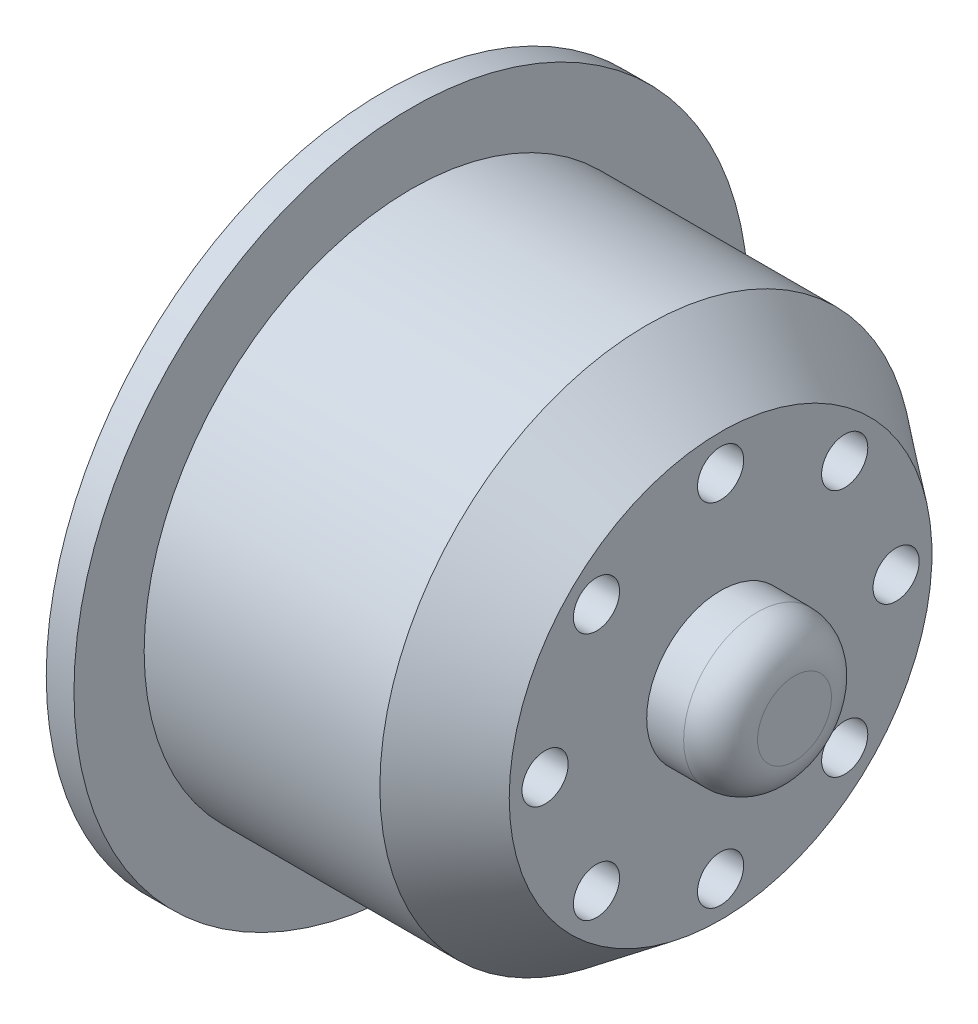
ISO-10303-21;
HEADER;
FILE_DESCRIPTION(('STEP AP214'),'2;1');
FILE_NAME('part.step','',(''),(''),'','','');
FILE_SCHEMA(('AUTOMOTIVE_DESIGN { 1 0 10303 214 1 1 1 1 }'));
ENDSEC;
DATA;
#1=APPLICATION_CONTEXT('core data for automotive mechanical design processes');
#2=APPLICATION_PROTOCOL_DEFINITION('international standard','automotive_design',2000,#1);
#3=PRODUCT_CONTEXT('',#1,'mechanical');
#4=PRODUCT('Part','Part','',(#3));
#5=PRODUCT_RELATED_PRODUCT_CATEGORY('part','',(#4));
#6=PRODUCT_DEFINITION_FORMATION('','',#4);
#7=PRODUCT_DEFINITION_CONTEXT('part definition',#1,'design');
#8=PRODUCT_DEFINITION('design','',#6,#7);
#9=PRODUCT_DEFINITION_SHAPE('','',#8);
#10=(LENGTH_UNIT() NAMED_UNIT(*) SI_UNIT(.MILLI.,.METRE.));
#11=(NAMED_UNIT(*) PLANE_ANGLE_UNIT() SI_UNIT($,.RADIAN.));
#12=(NAMED_UNIT(*) SI_UNIT($,.STERADIAN.) SOLID_ANGLE_UNIT());
#13=UNCERTAINTY_MEASURE_WITH_UNIT(LENGTH_MEASURE(1.E-05),#10,'distance_accuracy_value','');
#14=(GEOMETRIC_REPRESENTATION_CONTEXT(3) GLOBAL_UNCERTAINTY_ASSIGNED_CONTEXT((#13)) GLOBAL_UNIT_ASSIGNED_CONTEXT((#10,
#11,#12)) REPRESENTATION_CONTEXT('',''));
#15=CARTESIAN_POINT('',(0.,0.,0.));
#16=DIRECTION('',(0.,0.,1.));
#17=DIRECTION('',(1.,0.,0.));
#18=AXIS2_PLACEMENT_3D('',#15,#16,#17);
#19=CARTESIAN_POINT('',(-7.6304347826087,6.71751442127166,6.71751442127198));
#20=DIRECTION('',(1.,0.,0.));
#21=DIRECTION('',(0.,0.,-1.));
#22=AXIS2_PLACEMENT_3D('',#19,#20,#21);
#23=CYLINDRICAL_SURFACE('',#22,1.25);
#24=CARTESIAN_POINT('',(10.6195652173913,6.71751442127166,6.71751442127198));
#25=DIRECTION('',(1.,0.,0.));
#26=DIRECTION('',(0.,0.,-1.));
#27=AXIS2_PLACEMENT_3D('',#24,#25,#26);
#28=CIRCLE('',#27,1.25);
#29=CARTESIAN_POINT('',(10.6195652173913,6.71751442127166,5.46751442127198));
#30=VERTEX_POINT('',#29);
#31=EDGE_CURVE('E89',#30,#30,#28,.T.);
#32=ORIENTED_EDGE('',*,*,#31,.T.);
#33=EDGE_LOOP('',(#32));
#34=FACE_BOUND('',#33,.T.);
#35=CARTESIAN_POINT('',(5.61956521739131,6.71751442127166,6.71751442127198));
#36=DIRECTION('',(-1.,0.,0.));
#37=DIRECTION('',(0.,0.,1.));
#38=AXIS2_PLACEMENT_3D('',#35,#36,#37);
#39=CIRCLE('',#38,1.25);
#40=CARTESIAN_POINT('',(5.61956521739131,6.71751442127166,7.96751442127198));
#41=VERTEX_POINT('',#40);
#42=EDGE_CURVE('E43',#41,#41,#39,.F.);
#43=ORIENTED_EDGE('',*,*,#42,.F.);
#44=EDGE_LOOP('',(#43));
#45=FACE_BOUND('',#44,.T.);
#46=ADVANCED_FACE('F39',(#34,#45),#23,.F.);
#47=CARTESIAN_POINT('',(-7.6304347826087,-7.66926912071228E-13,9.49999999999923));
#48=DIRECTION('',(1.,0.,0.));
#49=DIRECTION('',(0.,0.,-1.));
#50=AXIS2_PLACEMENT_3D('',#47,#48,#49);
#51=CYLINDRICAL_SURFACE('',#50,1.25);
#52=CARTESIAN_POINT('',(10.6195652173913,-7.66926912071228E-13,9.49999999999923));
#53=DIRECTION('',(1.,0.,0.));
#54=DIRECTION('',(0.,0.,-1.));
#55=AXIS2_PLACEMENT_3D('',#52,#53,#54);
#56=CIRCLE('',#55,1.25);
#57=CARTESIAN_POINT('',(10.6195652173913,-7.66926912071228E-13,8.24999999999924));
#58=VERTEX_POINT('',#57);
#59=EDGE_CURVE('E94',#58,#58,#56,.T.);
#60=ORIENTED_EDGE('',*,*,#59,.T.);
#61=EDGE_LOOP('',(#60));
#62=FACE_BOUND('',#61,.T.);
#63=CARTESIAN_POINT('',(5.61956521739131,-7.66926912071228E-13,9.49999999999923));
#64=DIRECTION('',(-1.,0.,0.));
#65=DIRECTION('',(0.,0.,1.));
#66=AXIS2_PLACEMENT_3D('',#63,#64,#65);
#67=CIRCLE('',#66,1.25);
#68=CARTESIAN_POINT('',(5.61956521739131,-7.66926912071228E-13,10.7499999999992));
#69=VERTEX_POINT('',#68);
#70=EDGE_CURVE('E82',#69,#69,#67,.F.);
#71=ORIENTED_EDGE('',*,*,#70,.F.);
#72=EDGE_LOOP('',(#71));
#73=FACE_BOUND('',#72,.T.);
#74=ADVANCED_FACE('F166',(#62,#73),#51,.F.);
#75=CARTESIAN_POINT('',(-7.6304347826087,-6.71751442127274,6.7175144212709));
#76=DIRECTION('',(1.,0.,0.));
#77=DIRECTION('',(0.,0.,-1.));
#78=AXIS2_PLACEMENT_3D('',#75,#76,#77);
#79=CYLINDRICAL_SURFACE('',#78,1.25);
#80=CARTESIAN_POINT('',(10.6195652173913,-6.71751442127274,6.7175144212709));
#81=DIRECTION('',(1.,0.,0.));
#82=DIRECTION('',(0.,0.,-1.));
#83=AXIS2_PLACEMENT_3D('',#80,#81,#82);
#84=CIRCLE('',#83,1.25);
#85=CARTESIAN_POINT('',(10.6195652173913,-6.71751442127274,5.4675144212709));
#86=VERTEX_POINT('',#85);
#87=EDGE_CURVE('E100',#86,#86,#84,.T.);
#88=ORIENTED_EDGE('',*,*,#87,.T.);
#89=EDGE_LOOP('',(#88));
#90=FACE_BOUND('',#89,.T.);
#91=CARTESIAN_POINT('',(5.61956521739131,-6.71751442127274,6.7175144212709));
#92=DIRECTION('',(-1.,0.,0.));
#93=DIRECTION('',(0.,0.,1.));
#94=AXIS2_PLACEMENT_3D('',#91,#92,#93);
#95=CIRCLE('',#94,1.25);
#96=CARTESIAN_POINT('',(5.61956521739131,-6.71751442127274,7.9675144212709));
#97=VERTEX_POINT('',#96);
#98=EDGE_CURVE('E79',#97,#97,#95,.F.);
#99=ORIENTED_EDGE('',*,*,#98,.F.);
#100=EDGE_LOOP('',(#99));
#101=FACE_BOUND('',#100,.T.);
#102=ADVANCED_FACE('F171',(#90,#101),#79,.F.);
#103=CARTESIAN_POINT('',(-7.6304347826087,-9.5,-1.53152699522408E-12));
#104=DIRECTION('',(1.,0.,0.));
#105=DIRECTION('',(0.,0.,-1.));
#106=AXIS2_PLACEMENT_3D('',#103,#104,#105);
#107=CYLINDRICAL_SURFACE('',#106,1.25);
#108=CARTESIAN_POINT('',(10.6195652173913,-9.5,-1.53152699522408E-12));
#109=DIRECTION('',(1.,0.,0.));
#110=DIRECTION('',(0.,0.,-1.));
#111=AXIS2_PLACEMENT_3D('',#108,#109,#110);
#112=CIRCLE('',#111,1.25);
#113=CARTESIAN_POINT('',(10.6195652173913,-9.5,-1.25000000000153));
#114=VERTEX_POINT('',#113);
#115=EDGE_CURVE('E359',#114,#114,#112,.T.);
#116=ORIENTED_EDGE('',*,*,#115,.T.);
#117=EDGE_LOOP('',(#116));
#118=FACE_BOUND('',#117,.T.);
#119=CARTESIAN_POINT('',(5.61956521739131,-9.5,-1.53152699522408E-12));
#120=DIRECTION('',(-1.,0.,0.));
#121=DIRECTION('',(0.,0.,1.));
#122=AXIS2_PLACEMENT_3D('',#119,#120,#121);
#123=CIRCLE('',#122,1.25);
#124=CARTESIAN_POINT('',(5.61956521739131,-9.5,1.24999999999847));
#125=VERTEX_POINT('',#124);
#126=EDGE_CURVE('E75',#125,#125,#123,.F.);
#127=ORIENTED_EDGE('',*,*,#126,.F.);
#128=EDGE_LOOP('',(#127));
#129=FACE_BOUND('',#128,.T.);
#130=ADVANCED_FACE('F178',(#118,#129),#107,.F.);
#131=CARTESIAN_POINT('',(-7.6304347826087,-6.71751442127166,-6.71751442127351));
#132=DIRECTION('',(1.,0.,0.));
#133=DIRECTION('',(0.,0.,-1.));
#134=AXIS2_PLACEMENT_3D('',#131,#132,#133);
#135=CYLINDRICAL_SURFACE('',#134,1.25);
#136=CARTESIAN_POINT('',(10.6195652173913,-6.71751442127166,-6.71751442127351));
#137=DIRECTION('',(1.,0.,0.));
#138=DIRECTION('',(0.,0.,-1.));
#139=AXIS2_PLACEMENT_3D('',#136,#137,#138);
#140=CIRCLE('',#139,1.25);
#141=CARTESIAN_POINT('',(10.6195652173913,-6.71751442127166,-7.96751442127351));
#142=VERTEX_POINT('',#141);
#143=EDGE_CURVE('E355',#142,#142,#140,.T.);
#144=ORIENTED_EDGE('',*,*,#143,.T.);
#145=EDGE_LOOP('',(#144));
#146=FACE_BOUND('',#145,.T.);
#147=CARTESIAN_POINT('',(5.61956521739131,-6.71751442127166,-6.71751442127351));
#148=DIRECTION('',(-1.,0.,0.));
#149=DIRECTION('',(0.,0.,1.));
#150=AXIS2_PLACEMENT_3D('',#147,#148,#149);
#151=CIRCLE('',#150,1.25);
#152=CARTESIAN_POINT('',(5.61956521739131,-6.71751442127166,-5.46751442127351));
#153=VERTEX_POINT('',#152);
#154=EDGE_CURVE('E71',#153,#153,#151,.F.);
#155=ORIENTED_EDGE('',*,*,#154,.F.);
#156=EDGE_LOOP('',(#155));
#157=FACE_BOUND('',#156,.T.);
#158=ADVANCED_FACE('F182',(#146,#157),#135,.F.);
#159=CARTESIAN_POINT('',(-7.6304347826087,7.65763497612038E-13,-9.50000000000077));
#160=DIRECTION('',(1.,0.,0.));
#161=DIRECTION('',(0.,0.,-1.));
#162=AXIS2_PLACEMENT_3D('',#159,#160,#161);
#163=CYLINDRICAL_SURFACE('',#162,1.25);
#164=CARTESIAN_POINT('',(10.6195652173913,7.65763497612038E-13,-9.50000000000077));
#165=DIRECTION('',(1.,0.,0.));
#166=DIRECTION('',(0.,0.,-1.));
#167=AXIS2_PLACEMENT_3D('',#164,#165,#166);
#168=CIRCLE('',#167,1.25);
#169=CARTESIAN_POINT('',(10.6195652173913,7.65763497612038E-13,-10.7500000000008));
#170=VERTEX_POINT('',#169);
#171=EDGE_CURVE('E351',#170,#170,#168,.T.);
#172=ORIENTED_EDGE('',*,*,#171,.T.);
#173=EDGE_LOOP('',(#172));
#174=FACE_BOUND('',#173,.T.);
#175=CARTESIAN_POINT('',(5.61956521739131,7.65763497612038E-13,-9.50000000000077));
#176=DIRECTION('',(-1.,0.,0.));
#177=DIRECTION('',(0.,0.,1.));
#178=AXIS2_PLACEMENT_3D('',#175,#176,#177);
#179=CIRCLE('',#178,1.25);
#180=CARTESIAN_POINT('',(5.61956521739131,7.65763497612038E-13,-8.25000000000077));
#181=VERTEX_POINT('',#180);
#182=EDGE_CURVE('E67',#181,#181,#179,.F.);
#183=ORIENTED_EDGE('',*,*,#182,.F.);
#184=EDGE_LOOP('',(#183));
#185=FACE_BOUND('',#184,.T.);
#186=ADVANCED_FACE('F186',(#174,#185),#163,.F.);
#187=CARTESIAN_POINT('',(-7.6304347826087,6.71751442127274,-6.71751442127242));
#188=DIRECTION('',(1.,0.,0.));
#189=DIRECTION('',(0.,0.,-1.));
#190=AXIS2_PLACEMENT_3D('',#187,#188,#189);
#191=CYLINDRICAL_SURFACE('',#190,1.25);
#192=CARTESIAN_POINT('',(10.6195652173913,6.71751442127274,-6.71751442127242));
#193=DIRECTION('',(1.,0.,0.));
#194=DIRECTION('',(0.,0.,-1.));
#195=AXIS2_PLACEMENT_3D('',#192,#193,#194);
#196=CIRCLE('',#195,1.25);
#197=CARTESIAN_POINT('',(10.6195652173913,6.71751442127274,-7.96751442127243));
#198=VERTEX_POINT('',#197);
#199=EDGE_CURVE('E347',#198,#198,#196,.T.);
#200=ORIENTED_EDGE('',*,*,#199,.T.);
#201=EDGE_LOOP('',(#200));
#202=FACE_BOUND('',#201,.T.);
#203=CARTESIAN_POINT('',(5.61956521739131,6.71751442127274,-6.71751442127242));
#204=DIRECTION('',(-1.,0.,0.));
#205=DIRECTION('',(0.,0.,1.));
#206=AXIS2_PLACEMENT_3D('',#203,#204,#205);
#207=CIRCLE('',#206,1.25);
#208=CARTESIAN_POINT('',(5.61956521739131,6.71751442127274,-5.46751442127242));
#209=VERTEX_POINT('',#208);
#210=EDGE_CURVE('E62',#209,#209,#207,.F.);
#211=ORIENTED_EDGE('',*,*,#210,.F.);
#212=EDGE_LOOP('',(#211));
#213=FACE_BOUND('',#212,.T.);
#214=ADVANCED_FACE('F190',(#202,#213),#191,.F.);
#215=CARTESIAN_POINT('',(-7.6304347826087,9.5,0.));
#216=DIRECTION('',(1.,0.,0.));
#217=DIRECTION('',(0.,0.,-1.));
#218=AXIS2_PLACEMENT_3D('',#215,#216,#217);
#219=CYLINDRICAL_SURFACE('',#218,1.25);
#220=CARTESIAN_POINT('',(10.6195652173913,9.5,0.));
#221=DIRECTION('',(1.,0.,0.));
#222=DIRECTION('',(0.,0.,-1.));
#223=AXIS2_PLACEMENT_3D('',#220,#221,#222);
#224=CIRCLE('',#223,1.25);
#225=CARTESIAN_POINT('',(10.6195652173913,9.5,-1.25));
#226=VERTEX_POINT('',#225);
#227=EDGE_CURVE('E109',#226,#226,#224,.T.);
#228=ORIENTED_EDGE('',*,*,#227,.T.);
#229=EDGE_LOOP('',(#228));
#230=FACE_BOUND('',#229,.T.);
#231=CARTESIAN_POINT('',(5.61956521739131,9.5,0.));
#232=DIRECTION('',(-1.,0.,0.));
#233=DIRECTION('',(0.,0.,1.));
#234=AXIS2_PLACEMENT_3D('',#231,#232,#233);
#235=CIRCLE('',#234,1.25);
#236=CARTESIAN_POINT('',(5.61956521739131,9.5,1.25));
#237=VERTEX_POINT('',#236);
#238=EDGE_CURVE('E58',#237,#237,#235,.F.);
#239=ORIENTED_EDGE('',*,*,#238,.F.);
#240=EDGE_LOOP('',(#239));
#241=FACE_BOUND('',#240,.T.);
#242=ADVANCED_FACE('F133',(#230,#241),#219,.F.);
#243=CARTESIAN_POINT('',(-6.1304347826087,0.,-14.45));
#244=DIRECTION('',(-1.,0.,0.));
#245=DIRECTION('',(0.,0.,1.));
#246=AXIS2_PLACEMENT_3D('',#243,#244,#245);
#247=PLANE('',#246);
#248=CARTESIAN_POINT('',(-6.1304347826087,0.,0.));
#249=DIRECTION('',(-1.,0.,0.));
#250=DIRECTION('',(0.,0.,1.));
#251=AXIS2_PLACEMENT_3D('',#248,#249,#250);
#252=CIRCLE('',#251,18.25);
#253=CARTESIAN_POINT('',(-6.1304347826087,0.,18.25));
#254=VERTEX_POINT('',#253);
#255=EDGE_CURVE('E54',#254,#254,#252,.T.);
#256=ORIENTED_EDGE('',*,*,#255,.F.);
#257=EDGE_LOOP('',(#256));
#258=FACE_BOUND('',#257,.T.);
#259=CARTESIAN_POINT('',(-6.1304347826087,0.,0.));
#260=DIRECTION('',(-1.,0.,0.));
#261=DIRECTION('',(0.,0.,1.));
#262=AXIS2_PLACEMENT_3D('',#259,#260,#261);
#263=CIRCLE('',#262,14.45);
#264=CARTESIAN_POINT('',(-6.1304347826087,0.,14.45));
#265=VERTEX_POINT('',#264);
#266=EDGE_CURVE('E104',#265,#265,#263,.T.);
#267=ORIENTED_EDGE('',*,*,#266,.T.);
#268=EDGE_LOOP('',(#267));
#269=FACE_BOUND('',#268,.T.);
#270=ADVANCED_FACE('F130',(#258,#269),#247,.F.);
#271=CARTESIAN_POINT('',(-12.3913043478261,0.,0.));
#272=DIRECTION('',(-1.,0.,0.));
#273=DIRECTION('',(0.,0.,1.));
#274=AXIS2_PLACEMENT_3D('',#271,#272,#273);
#275=CYLINDRICAL_SURFACE('',#274,18.25);
#276=CARTESIAN_POINT('',(-7.6304347826087,0.,0.));
#277=DIRECTION('',(-1.,0.,0.));
#278=DIRECTION('',(0.,0.,1.));
#279=AXIS2_PLACEMENT_3D('',#276,#277,#278);
#280=CIRCLE('',#279,18.25);
#281=CARTESIAN_POINT('',(-7.6304347826087,0.,18.25));
#282=VERTEX_POINT('',#281);
#283=EDGE_CURVE('E121',#282,#282,#280,.T.);
#284=ORIENTED_EDGE('',*,*,#283,.F.);
#285=EDGE_LOOP('',(#284));
#286=FACE_BOUND('',#285,.T.);
#287=ORIENTED_EDGE('',*,*,#255,.T.);
#288=EDGE_LOOP('',(#287));
#289=FACE_BOUND('',#288,.T.);
#290=ADVANCED_FACE('F128',(#286,#289),#275,.T.);
#291=CARTESIAN_POINT('',(-7.6304347826087,0.,-18.25));
#292=DIRECTION('',(1.,0.,0.));
#293=DIRECTION('',(0.,0.,-1.));
#294=AXIS2_PLACEMENT_3D('',#291,#292,#293);
#295=PLANE('',#294);
#296=CARTESIAN_POINT('',(-7.6304347826087,0.,0.));
#297=DIRECTION('',(-1.,0.,0.));
#298=DIRECTION('',(0.,0.,1.));
#299=AXIS2_PLACEMENT_3D('',#296,#297,#298);
#300=CIRCLE('',#299,4.65);
#301=CARTESIAN_POINT('',(-7.6304347826087,0.,4.65));
#302=VERTEX_POINT('',#301);
#303=EDGE_CURVE('E276',#302,#302,#300,.T.);
#304=ORIENTED_EDGE('',*,*,#303,.F.);
#305=EDGE_LOOP('',(#304));
#306=FACE_BOUND('',#305,.T.);
#307=CARTESIAN_POINT('',(-7.6304347826087,6.71751442127125,-6.71751442127159));
#308=DIRECTION('',(-1.,0.,0.));
#309=DIRECTION('',(0.,0.,1.));
#310=AXIS2_PLACEMENT_3D('',#307,#308,#309);
#311=CIRCLE('',#310,2.50000000000051);
#312=CARTESIAN_POINT('',(-7.6304347826087,6.71751442127125,-4.21751442127108));
#313=VERTEX_POINT('',#312);
#314=EDGE_CURVE('E275',#313,#313,#311,.T.);
#315=ORIENTED_EDGE('',*,*,#314,.F.);
#316=EDGE_LOOP('',(#315));
#317=FACE_BOUND('',#316,.T.);
#318=CARTESIAN_POINT('',(-7.6304347826087,-8.09437011536873E-13,-9.49999999999865));
#319=DIRECTION('',(-1.,0.,0.));
#320=DIRECTION('',(0.,0.,1.));
#321=AXIS2_PLACEMENT_3D('',#318,#319,#320);
#322=CIRCLE('',#321,2.5000000000011);
#323=CARTESIAN_POINT('',(-7.6304347826087,-8.09437011536873E-13,-6.99999999999755));
#324=VERTEX_POINT('',#323);
#325=EDGE_CURVE('E328',#324,#324,#322,.T.);
#326=ORIENTED_EDGE('',*,*,#325,.F.);
#327=EDGE_LOOP('',(#326));
#328=FACE_BOUND('',#327,.T.);
#329=CARTESIAN_POINT('',(-7.6304347826087,-6.71751442127239,-6.71751442127044));
#330=DIRECTION('',(-1.,0.,0.));
#331=DIRECTION('',(0.,0.,1.));
#332=AXIS2_PLACEMENT_3D('',#329,#330,#331);
#333=CIRCLE('',#332,2.50000000000157);
#334=CARTESIAN_POINT('',(-7.6304347826087,-6.71751442127239,-4.21751442126887));
#335=VERTEX_POINT('',#334);
#336=EDGE_CURVE('E320',#335,#335,#333,.T.);
#337=ORIENTED_EDGE('',*,*,#336,.F.);
#338=EDGE_LOOP('',(#337));
#339=FACE_BOUND('',#338,.T.);
#340=CARTESIAN_POINT('',(-7.6304347826087,-9.49999999999946,1.61654719415537E-12));
#341=DIRECTION('',(-1.,0.,0.));
#342=DIRECTION('',(0.,0.,1.));
#343=AXIS2_PLACEMENT_3D('',#340,#341,#342);
#344=CIRCLE('',#343,2.50000000000161);
#345=CARTESIAN_POINT('',(-7.6304347826087,-9.49999999999946,2.50000000000323));
#346=VERTEX_POINT('',#345);
#347=EDGE_CURVE('E312',#346,#346,#344,.T.);
#348=ORIENTED_EDGE('',*,*,#347,.F.);
#349=EDGE_LOOP('',(#348));
#350=FACE_BOUND('',#349,.T.);
#351=CARTESIAN_POINT('',(-7.6304347826087,-6.71751442127125,6.7175144212732));
#352=DIRECTION('',(-1.,0.,0.));
#353=DIRECTION('',(0.,0.,1.));
#354=AXIS2_PLACEMENT_3D('',#351,#352,#353);
#355=CIRCLE('',#354,2.5000000000012);
#356=CARTESIAN_POINT('',(-7.6304347826087,-6.71751442127125,9.2175144212744));
#357=VERTEX_POINT('',#356);
#358=EDGE_CURVE('E304',#357,#357,#355,.T.);
#359=ORIENTED_EDGE('',*,*,#358,.F.);
#360=EDGE_LOOP('',(#359));
#361=FACE_BOUND('',#360,.T.);
#362=CARTESIAN_POINT('',(-7.6304347826087,8.08273597077683E-13,9.50000000000027));
#363=DIRECTION('',(-1.,0.,0.));
#364=DIRECTION('',(0.,0.,1.));
#365=AXIS2_PLACEMENT_3D('',#362,#363,#364);
#366=CIRCLE('',#365,2.50000000000057);
#367=CARTESIAN_POINT('',(-7.6304347826087,8.08273597077683E-13,12.0000000000008));
#368=VERTEX_POINT('',#367);
#369=EDGE_CURVE('E296',#368,#368,#366,.T.);
#370=ORIENTED_EDGE('',*,*,#369,.F.);
#371=EDGE_LOOP('',(#370));
#372=FACE_BOUND('',#371,.T.);
#373=CARTESIAN_POINT('',(-7.6304347826087,6.71751442127239,6.71751442127206));
#374=DIRECTION('',(-1.,0.,0.));
#375=DIRECTION('',(0.,0.,1.));
#376=AXIS2_PLACEMENT_3D('',#373,#374,#375);
#377=CIRCLE('',#376,2.50000000000008);
#378=CARTESIAN_POINT('',(-7.6304347826087,6.71751442127239,9.21751442127213));
#379=VERTEX_POINT('',#378);
#380=EDGE_CURVE('E286',#379,#379,#377,.T.);
#381=ORIENTED_EDGE('',*,*,#380,.F.);
#382=EDGE_LOOP('',(#381));
#383=FACE_BOUND('',#382,.T.);
#384=CARTESIAN_POINT('',(-7.6304347826087,9.49999999999946,0.));
#385=DIRECTION('',(-1.,0.,0.));
#386=DIRECTION('',(0.,0.,1.));
#387=AXIS2_PLACEMENT_3D('',#384,#385,#386);
#388=CIRCLE('',#387,2.5);
#389=CARTESIAN_POINT('',(-7.6304347826087,9.49999999999946,2.5));
#390=VERTEX_POINT('',#389);
#391=EDGE_CURVE('E295',#390,#390,#388,.T.);
#392=ORIENTED_EDGE('',*,*,#391,.F.);
#393=EDGE_LOOP('',(#392));
#394=FACE_BOUND('',#393,.T.);
#395=ORIENTED_EDGE('',*,*,#283,.T.);
#396=EDGE_LOOP('',(#395));
#397=FACE_BOUND('',#396,.T.);
#398=ADVANCED_FACE('F163',(#306,#317,#328,#339,#350,#361,#372,#383,#394,#397),#295,.F.);
#399=CARTESIAN_POINT('',(14.6195652173913,0.,-4.));
#400=DIRECTION('',(-1.,0.,0.));
#401=DIRECTION('',(0.,0.,1.));
#402=AXIS2_PLACEMENT_3D('',#399,#400,#401);
#403=PLANE('',#402);
#404=CARTESIAN_POINT('',(14.6195652173913,0.,0.));
#405=DIRECTION('',(-1.,0.,0.));
#406=DIRECTION('',(0.,0.,1.));
#407=AXIS2_PLACEMENT_3D('',#404,#405,#406);
#408=CIRCLE('',#407,2.);
#409=CARTESIAN_POINT('',(14.6195652173913,0.,2.));
#410=VERTEX_POINT('',#409);
#411=EDGE_CURVE('E11',#410,#410,#408,.F.);
#412=ORIENTED_EDGE('',*,*,#411,.T.);
#413=EDGE_LOOP('',(#412));
#414=FACE_BOUND('',#413,.T.);
#415=ADVANCED_FACE('F157',(#414),#403,.F.);
#416=CARTESIAN_POINT('',(-12.3913043478261,0.,0.));
#417=DIRECTION('',(-1.,0.,0.));
#418=DIRECTION('',(0.,0.,1.));
#419=AXIS2_PLACEMENT_3D('',#416,#417,#418);
#420=CYLINDRICAL_SURFACE('',#419,4.);
#421=CARTESIAN_POINT('',(12.6195652173913,0.,0.));
#422=DIRECTION('',(-1.,0.,0.));
#423=DIRECTION('',(0.,0.,1.));
#424=AXIS2_PLACEMENT_3D('',#421,#422,#423);
#425=CIRCLE('',#424,4.);
#426=CARTESIAN_POINT('',(12.6195652173913,0.,4.));
#427=VERTEX_POINT('',#426);
#428=EDGE_CURVE('E48',#427,#427,#425,.T.);
#429=ORIENTED_EDGE('',*,*,#428,.T.);
#430=EDGE_LOOP('',(#429));
#431=FACE_BOUND('',#430,.T.);
#432=CARTESIAN_POINT('',(10.6195652173913,0.,0.));
#433=DIRECTION('',(-1.,0.,0.));
#434=DIRECTION('',(0.,0.,1.));
#435=AXIS2_PLACEMENT_3D('',#432,#433,#434);
#436=CIRCLE('',#435,4.);
#437=CARTESIAN_POINT('',(10.6195652173913,0.,4.));
#438=VERTEX_POINT('',#437);
#439=EDGE_CURVE('E117',#438,#438,#436,.T.);
#440=ORIENTED_EDGE('',*,*,#439,.F.);
#441=EDGE_LOOP('',(#440));
#442=FACE_BOUND('',#441,.T.);
#443=ADVANCED_FACE('F151',(#431,#442),#420,.T.);
#444=CARTESIAN_POINT('',(10.6195652173913,0.,-11.4409248842397));
#445=DIRECTION('',(-1.,0.,0.));
#446=DIRECTION('',(0.,0.,1.));
#447=AXIS2_PLACEMENT_3D('',#444,#445,#446);
#448=PLANE('',#447);
#449=ORIENTED_EDGE('',*,*,#227,.F.);
#450=EDGE_LOOP('',(#449));
#451=FACE_BOUND('',#450,.T.);
#452=ORIENTED_EDGE('',*,*,#199,.F.);
#453=EDGE_LOOP('',(#452));
#454=FACE_BOUND('',#453,.T.);
#455=ORIENTED_EDGE('',*,*,#171,.F.);
#456=EDGE_LOOP('',(#455));
#457=FACE_BOUND('',#456,.T.);
#458=ORIENTED_EDGE('',*,*,#143,.F.);
#459=EDGE_LOOP('',(#458));
#460=FACE_BOUND('',#459,.T.);
#461=ORIENTED_EDGE('',*,*,#115,.F.);
#462=EDGE_LOOP('',(#461));
#463=FACE_BOUND('',#462,.T.);
#464=ORIENTED_EDGE('',*,*,#87,.F.);
#465=EDGE_LOOP('',(#464));
#466=FACE_BOUND('',#465,.T.);
#467=ORIENTED_EDGE('',*,*,#59,.F.);
#468=EDGE_LOOP('',(#467));
#469=FACE_BOUND('',#468,.T.);
#470=ORIENTED_EDGE('',*,*,#31,.F.);
#471=EDGE_LOOP('',(#470));
#472=FACE_BOUND('',#471,.T.);
#473=CARTESIAN_POINT('',(10.6195652173913,0.,0.));
#474=DIRECTION('',(-1.,0.,0.));
#475=DIRECTION('',(0.,0.,1.));
#476=AXIS2_PLACEMENT_3D('',#473,#474,#475);
#477=CIRCLE('',#476,11.4409248842397);
#478=CARTESIAN_POINT('',(10.6195652173913,0.,11.4409248842397));
#479=VERTEX_POINT('',#478);
#480=EDGE_CURVE('E113',#479,#479,#477,.T.);
#481=ORIENTED_EDGE('',*,*,#480,.F.);
#482=EDGE_LOOP('',(#481));
#483=FACE_BOUND('',#482,.T.);
#484=ORIENTED_EDGE('',*,*,#439,.T.);
#485=EDGE_LOOP('',(#484));
#486=FACE_BOUND('',#485,.T.);
#487=ADVANCED_FACE('F145',(#451,#454,#457,#460,#463,#466,#469,#472,#483,#486),#448,.F.);
#488=CARTESIAN_POINT('',(10.6195652173913,0.,0.));
#489=DIRECTION('',(-1.,0.,0.));
#490=DIRECTION('',(0.,0.,1.));
#491=AXIS2_PLACEMENT_3D('',#488,#489,#490);
#492=CONICAL_SURFACE('',#491,11.4409248842397,0.645771823237905);
#493=CARTESIAN_POINT('',(6.62638766715485,0.,0.));
#494=DIRECTION('',(-1.,0.,0.));
#495=DIRECTION('',(0.,0.,1.));
#496=AXIS2_PLACEMENT_3D('',#493,#494,#495);
#497=CIRCLE('',#496,14.45);
#498=CARTESIAN_POINT('',(6.62638766715485,0.,14.45));
#499=VERTEX_POINT('',#498);
#500=EDGE_CURVE('E108',#499,#499,#497,.T.);
#501=ORIENTED_EDGE('',*,*,#500,.F.);
#502=EDGE_LOOP('',(#501));
#503=FACE_BOUND('',#502,.T.);
#504=ORIENTED_EDGE('',*,*,#480,.T.);
#505=EDGE_LOOP('',(#504));
#506=FACE_BOUND('',#505,.T.);
#507=ADVANCED_FACE('F139',(#503,#506),#492,.T.);
#508=CARTESIAN_POINT('',(-12.3913043478261,0.,0.));
#509=DIRECTION('',(-1.,0.,0.));
#510=DIRECTION('',(0.,0.,1.));
#511=AXIS2_PLACEMENT_3D('',#508,#509,#510);
#512=CYLINDRICAL_SURFACE('',#511,14.45);
#513=ORIENTED_EDGE('',*,*,#266,.F.);
#514=EDGE_LOOP('',(#513));
#515=FACE_BOUND('',#514,.T.);
#516=ORIENTED_EDGE('',*,*,#500,.T.);
#517=EDGE_LOOP('',(#516));
#518=FACE_BOUND('',#517,.T.);
#519=ADVANCED_FACE('F136',(#515,#518),#512,.T.);
#520=CARTESIAN_POINT('',(12.6195652173913,0.,0.));
#521=DIRECTION('',(-1.,0.,0.));
#522=DIRECTION('',(0.,0.,1.));
#523=AXIS2_PLACEMENT_3D('',#520,#521,#522);
#524=DEGENERATE_TOROIDAL_SURFACE('',#523,2.,2.,.T.);
#525=ORIENTED_EDGE('',*,*,#411,.F.);
#526=EDGE_LOOP('',(#525));
#527=FACE_BOUND('',#526,.T.);
#528=ORIENTED_EDGE('',*,*,#428,.F.);
#529=EDGE_LOOP('',(#528));
#530=FACE_BOUND('',#529,.T.);
#531=ADVANCED_FACE('F41',(#527,#530),#524,.T.);
#532=CARTESIAN_POINT('',(5.61956521739131,0.,-11.4409248842397));
#533=DIRECTION('',(-1.,0.,0.));
#534=DIRECTION('',(0.,0.,1.));
#535=AXIS2_PLACEMENT_3D('',#532,#533,#534);
#536=PLANE('',#535);
#537=CARTESIAN_POINT('',(5.61956521739131,9.49999999999946,0.));
#538=DIRECTION('',(-1.,0.,0.));
#539=DIRECTION('',(0.,0.,1.));
#540=AXIS2_PLACEMENT_3D('',#537,#538,#539);
#541=CIRCLE('',#540,2.5);
#542=CARTESIAN_POINT('',(5.61956521739131,9.49999999999946,2.5));
#543=VERTEX_POINT('',#542);
#544=EDGE_CURVE('E63',#543,#543,#541,.F.);
#545=ORIENTED_EDGE('',*,*,#544,.F.);
#546=EDGE_LOOP('',(#545));
#547=FACE_BOUND('',#546,.T.);
#548=ORIENTED_EDGE('',*,*,#238,.T.);
#549=EDGE_LOOP('',(#548));
#550=FACE_BOUND('',#549,.T.);
#551=ADVANCED_FACE('F202',(#547,#550),#536,.T.);
#552=CARTESIAN_POINT('',(17.6906330292613,9.49999999999946,0.));
#553=DIRECTION('',(-1.,0.,0.));
#554=DIRECTION('',(0.,0.,1.));
#555=AXIS2_PLACEMENT_3D('',#552,#553,#554);
#556=CYLINDRICAL_SURFACE('',#555,2.5);
#557=ORIENTED_EDGE('',*,*,#544,.T.);
#558=EDGE_LOOP('',(#557));
#559=FACE_BOUND('',#558,.T.);
#560=ORIENTED_EDGE('',*,*,#391,.T.);
#561=EDGE_LOOP('',(#560));
#562=FACE_BOUND('',#561,.T.);
#563=ADVANCED_FACE('F198',(#559,#562),#556,.F.);
#564=CARTESIAN_POINT('',(5.61956521739131,0.,-11.4409248842397));
#565=DIRECTION('',(-1.,0.,0.));
#566=DIRECTION('',(0.,0.,1.));
#567=AXIS2_PLACEMENT_3D('',#564,#565,#566);
#568=PLANE('',#567);
#569=CARTESIAN_POINT('',(5.61956521739131,6.71751442127125,-6.71751442127159));
#570=DIRECTION('',(-1.,0.,0.));
#571=DIRECTION('',(0.,0.,1.));
#572=AXIS2_PLACEMENT_3D('',#569,#570,#571);
#573=CIRCLE('',#572,2.50000000000051);
#574=CARTESIAN_POINT('',(5.61956521739131,6.71751442127125,-4.21751442127108));
#575=VERTEX_POINT('',#574);
#576=EDGE_CURVE('E281',#575,#575,#573,.F.);
#577=ORIENTED_EDGE('',*,*,#576,.F.);
#578=EDGE_LOOP('',(#577));
#579=FACE_BOUND('',#578,.T.);
#580=ORIENTED_EDGE('',*,*,#210,.T.);
#581=EDGE_LOOP('',(#580));
#582=FACE_BOUND('',#581,.T.);
#583=ADVANCED_FACE('F201',(#579,#582),#568,.T.);
#584=CARTESIAN_POINT('',(17.6906330292613,6.71751442127125,-6.71751442127159));
#585=DIRECTION('',(-1.,0.,0.));
#586=DIRECTION('',(0.,0.,1.));
#587=AXIS2_PLACEMENT_3D('',#584,#585,#586);
#588=CYLINDRICAL_SURFACE('',#587,2.50000000000051);
#589=ORIENTED_EDGE('',*,*,#576,.T.);
#590=EDGE_LOOP('',(#589));
#591=FACE_BOUND('',#590,.T.);
#592=ORIENTED_EDGE('',*,*,#314,.T.);
#593=EDGE_LOOP('',(#592));
#594=FACE_BOUND('',#593,.T.);
#595=ADVANCED_FACE('F207',(#591,#594),#588,.F.);
#596=CARTESIAN_POINT('',(5.61956521739131,0.,-11.4409248842397));
#597=DIRECTION('',(-1.,0.,0.));
#598=DIRECTION('',(0.,0.,1.));
#599=AXIS2_PLACEMENT_3D('',#596,#597,#598);
#600=PLANE('',#599);
#601=CARTESIAN_POINT('',(5.61956521739131,-8.09437011536873E-13,-9.49999999999865));
#602=DIRECTION('',(-1.,0.,0.));
#603=DIRECTION('',(0.,0.,1.));
#604=AXIS2_PLACEMENT_3D('',#601,#602,#603);
#605=CIRCLE('',#604,2.5000000000011);
#606=CARTESIAN_POINT('',(5.61956521739131,-8.09437011536873E-13,-6.99999999999755));
#607=VERTEX_POINT('',#606);
#608=EDGE_CURVE('E324',#607,#607,#605,.F.);
#609=ORIENTED_EDGE('',*,*,#608,.F.);
#610=EDGE_LOOP('',(#609));
#611=FACE_BOUND('',#610,.T.);
#612=ORIENTED_EDGE('',*,*,#182,.T.);
#613=EDGE_LOOP('',(#612));
#614=FACE_BOUND('',#613,.T.);
#615=ADVANCED_FACE('F210',(#611,#614),#600,.T.);
#616=CARTESIAN_POINT('',(17.6906330292613,-8.09437011536873E-13,-9.49999999999865));
#617=DIRECTION('',(-1.,0.,0.));
#618=DIRECTION('',(0.,0.,1.));
#619=AXIS2_PLACEMENT_3D('',#616,#617,#618);
#620=CYLINDRICAL_SURFACE('',#619,2.5000000000011);
#621=ORIENTED_EDGE('',*,*,#608,.T.);
#622=EDGE_LOOP('',(#621));
#623=FACE_BOUND('',#622,.T.);
#624=ORIENTED_EDGE('',*,*,#325,.T.);
#625=EDGE_LOOP('',(#624));
#626=FACE_BOUND('',#625,.T.);
#627=ADVANCED_FACE('F215',(#623,#626),#620,.F.);
#628=CARTESIAN_POINT('',(5.61956521739131,0.,-11.4409248842397));
#629=DIRECTION('',(-1.,0.,0.));
#630=DIRECTION('',(0.,0.,1.));
#631=AXIS2_PLACEMENT_3D('',#628,#629,#630);
#632=PLANE('',#631);
#633=CARTESIAN_POINT('',(5.61956521739131,-6.71751442127239,-6.71751442127044));
#634=DIRECTION('',(-1.,0.,0.));
#635=DIRECTION('',(0.,0.,1.));
#636=AXIS2_PLACEMENT_3D('',#633,#634,#635);
#637=CIRCLE('',#636,2.50000000000157);
#638=CARTESIAN_POINT('',(5.61956521739131,-6.71751442127239,-4.21751442126887));
#639=VERTEX_POINT('',#638);
#640=EDGE_CURVE('E316',#639,#639,#637,.F.);
#641=ORIENTED_EDGE('',*,*,#640,.F.);
#642=EDGE_LOOP('',(#641));
#643=FACE_BOUND('',#642,.T.);
#644=ORIENTED_EDGE('',*,*,#154,.T.);
#645=EDGE_LOOP('',(#644));
#646=FACE_BOUND('',#645,.T.);
#647=ADVANCED_FACE('F218',(#643,#646),#632,.T.);
#648=CARTESIAN_POINT('',(17.6906330292613,-6.71751442127239,-6.71751442127044));
#649=DIRECTION('',(-1.,0.,0.));
#650=DIRECTION('',(0.,0.,1.));
#651=AXIS2_PLACEMENT_3D('',#648,#649,#650);
#652=CYLINDRICAL_SURFACE('',#651,2.50000000000157);
#653=ORIENTED_EDGE('',*,*,#640,.T.);
#654=EDGE_LOOP('',(#653));
#655=FACE_BOUND('',#654,.T.);
#656=ORIENTED_EDGE('',*,*,#336,.T.);
#657=EDGE_LOOP('',(#656));
#658=FACE_BOUND('',#657,.T.);
#659=ADVANCED_FACE('F223',(#655,#658),#652,.F.);
#660=CARTESIAN_POINT('',(5.61956521739131,0.,-11.4409248842397));
#661=DIRECTION('',(-1.,0.,0.));
#662=DIRECTION('',(0.,0.,1.));
#663=AXIS2_PLACEMENT_3D('',#660,#661,#662);
#664=PLANE('',#663);
#665=CARTESIAN_POINT('',(5.61956521739131,-9.49999999999946,1.61654719415537E-12));
#666=DIRECTION('',(-1.,0.,0.));
#667=DIRECTION('',(0.,0.,1.));
#668=AXIS2_PLACEMENT_3D('',#665,#666,#667);
#669=CIRCLE('',#668,2.50000000000161);
#670=CARTESIAN_POINT('',(5.61956521739131,-9.49999999999946,2.50000000000323));
#671=VERTEX_POINT('',#670);
#672=EDGE_CURVE('E308',#671,#671,#669,.F.);
#673=ORIENTED_EDGE('',*,*,#672,.F.);
#674=EDGE_LOOP('',(#673));
#675=FACE_BOUND('',#674,.T.);
#676=ORIENTED_EDGE('',*,*,#126,.T.);
#677=EDGE_LOOP('',(#676));
#678=FACE_BOUND('',#677,.T.);
#679=ADVANCED_FACE('F226',(#675,#678),#664,.T.);
#680=CARTESIAN_POINT('',(17.6906330292613,-9.49999999999946,1.61654719415537E-12));
#681=DIRECTION('',(-1.,0.,0.));
#682=DIRECTION('',(0.,0.,1.));
#683=AXIS2_PLACEMENT_3D('',#680,#681,#682);
#684=CYLINDRICAL_SURFACE('',#683,2.50000000000161);
#685=ORIENTED_EDGE('',*,*,#672,.T.);
#686=EDGE_LOOP('',(#685));
#687=FACE_BOUND('',#686,.T.);
#688=ORIENTED_EDGE('',*,*,#347,.T.);
#689=EDGE_LOOP('',(#688));
#690=FACE_BOUND('',#689,.T.);
#691=ADVANCED_FACE('F231',(#687,#690),#684,.F.);
#692=CARTESIAN_POINT('',(5.61956521739131,0.,-11.4409248842397));
#693=DIRECTION('',(-1.,0.,0.));
#694=DIRECTION('',(0.,0.,1.));
#695=AXIS2_PLACEMENT_3D('',#692,#693,#694);
#696=PLANE('',#695);
#697=CARTESIAN_POINT('',(5.61956521739131,-6.71751442127125,6.7175144212732));
#698=DIRECTION('',(-1.,0.,0.));
#699=DIRECTION('',(0.,0.,1.));
#700=AXIS2_PLACEMENT_3D('',#697,#698,#699);
#701=CIRCLE('',#700,2.5000000000012);
#702=CARTESIAN_POINT('',(5.61956521739131,-6.71751442127125,9.2175144212744));
#703=VERTEX_POINT('',#702);
#704=EDGE_CURVE('E300',#703,#703,#701,.F.);
#705=ORIENTED_EDGE('',*,*,#704,.F.);
#706=EDGE_LOOP('',(#705));
#707=FACE_BOUND('',#706,.T.);
#708=ORIENTED_EDGE('',*,*,#98,.T.);
#709=EDGE_LOOP('',(#708));
#710=FACE_BOUND('',#709,.T.);
#711=ADVANCED_FACE('F234',(#707,#710),#696,.T.);
#712=CARTESIAN_POINT('',(17.6906330292613,-6.71751442127125,6.7175144212732));
#713=DIRECTION('',(-1.,0.,0.));
#714=DIRECTION('',(0.,0.,1.));
#715=AXIS2_PLACEMENT_3D('',#712,#713,#714);
#716=CYLINDRICAL_SURFACE('',#715,2.5000000000012);
#717=ORIENTED_EDGE('',*,*,#704,.T.);
#718=EDGE_LOOP('',(#717));
#719=FACE_BOUND('',#718,.T.);
#720=ORIENTED_EDGE('',*,*,#358,.T.);
#721=EDGE_LOOP('',(#720));
#722=FACE_BOUND('',#721,.T.);
#723=ADVANCED_FACE('F239',(#719,#722),#716,.F.);
#724=CARTESIAN_POINT('',(5.61956521739131,0.,-11.4409248842397));
#725=DIRECTION('',(-1.,0.,0.));
#726=DIRECTION('',(0.,0.,1.));
#727=AXIS2_PLACEMENT_3D('',#724,#725,#726);
#728=PLANE('',#727);
#729=CARTESIAN_POINT('',(5.61956521739131,8.08273597077683E-13,9.50000000000027));
#730=DIRECTION('',(-1.,0.,0.));
#731=DIRECTION('',(0.,0.,1.));
#732=AXIS2_PLACEMENT_3D('',#729,#730,#731);
#733=CIRCLE('',#732,2.50000000000057);
#734=CARTESIAN_POINT('',(5.61956521739131,8.08273597077683E-13,12.0000000000008));
#735=VERTEX_POINT('',#734);
#736=EDGE_CURVE('E291',#735,#735,#733,.F.);
#737=ORIENTED_EDGE('',*,*,#736,.F.);
#738=EDGE_LOOP('',(#737));
#739=FACE_BOUND('',#738,.T.);
#740=ORIENTED_EDGE('',*,*,#70,.T.);
#741=EDGE_LOOP('',(#740));
#742=FACE_BOUND('',#741,.T.);
#743=ADVANCED_FACE('F242',(#739,#742),#728,.T.);
#744=CARTESIAN_POINT('',(17.6906330292613,8.08273597077683E-13,9.50000000000027));
#745=DIRECTION('',(-1.,0.,0.));
#746=DIRECTION('',(0.,0.,1.));
#747=AXIS2_PLACEMENT_3D('',#744,#745,#746);
#748=CYLINDRICAL_SURFACE('',#747,2.50000000000057);
#749=ORIENTED_EDGE('',*,*,#736,.T.);
#750=EDGE_LOOP('',(#749));
#751=FACE_BOUND('',#750,.T.);
#752=ORIENTED_EDGE('',*,*,#369,.T.);
#753=EDGE_LOOP('',(#752));
#754=FACE_BOUND('',#753,.T.);
#755=ADVANCED_FACE('F247',(#751,#754),#748,.F.);
#756=CARTESIAN_POINT('',(5.61956521739131,0.,-11.4409248842397));
#757=DIRECTION('',(-1.,0.,0.));
#758=DIRECTION('',(0.,0.,1.));
#759=AXIS2_PLACEMENT_3D('',#756,#757,#758);
#760=PLANE('',#759);
#761=CARTESIAN_POINT('',(5.61956521739131,6.71751442127239,6.71751442127206));
#762=DIRECTION('',(-1.,0.,0.));
#763=DIRECTION('',(0.,0.,1.));
#764=AXIS2_PLACEMENT_3D('',#761,#762,#763);
#765=CIRCLE('',#764,2.50000000000008);
#766=CARTESIAN_POINT('',(5.61956521739131,6.71751442127239,9.21751442127213));
#767=VERTEX_POINT('',#766);
#768=EDGE_CURVE('E290',#767,#767,#765,.F.);
#769=ORIENTED_EDGE('',*,*,#768,.F.);
#770=EDGE_LOOP('',(#769));
#771=FACE_BOUND('',#770,.T.);
#772=ORIENTED_EDGE('',*,*,#42,.T.);
#773=EDGE_LOOP('',(#772));
#774=FACE_BOUND('',#773,.T.);
#775=ADVANCED_FACE('F250',(#771,#774),#760,.T.);
#776=CARTESIAN_POINT('',(17.6906330292613,6.71751442127239,6.71751442127206));
#777=DIRECTION('',(-1.,0.,0.));
#778=DIRECTION('',(0.,0.,1.));
#779=AXIS2_PLACEMENT_3D('',#776,#777,#778);
#780=CYLINDRICAL_SURFACE('',#779,2.50000000000008);
#781=ORIENTED_EDGE('',*,*,#768,.T.);
#782=EDGE_LOOP('',(#781));
#783=FACE_BOUND('',#782,.T.);
#784=ORIENTED_EDGE('',*,*,#380,.T.);
#785=EDGE_LOOP('',(#784));
#786=FACE_BOUND('',#785,.T.);
#787=ADVANCED_FACE('F255',(#783,#786),#780,.F.);
#788=CARTESIAN_POINT('',(2.36956521739131,0.,0.));
#789=DIRECTION('',(-1.,0.,0.));
#790=DIRECTION('',(0.,0.,1.));
#791=AXIS2_PLACEMENT_3D('',#788,#789,#790);
#792=CYLINDRICAL_SURFACE('',#791,4.65);
#793=CARTESIAN_POINT('',(2.36956521739131,0.,0.));
#794=DIRECTION('',(-1.,0.,0.));
#795=DIRECTION('',(0.,0.,1.));
#796=AXIS2_PLACEMENT_3D('',#793,#794,#795);
#797=CIRCLE('',#796,4.65);
#798=CARTESIAN_POINT('',(2.36956521739131,0.,4.65));
#799=VERTEX_POINT('',#798);
#800=EDGE_CURVE('E273',#799,#799,#797,.T.);
#801=ORIENTED_EDGE('',*,*,#800,.F.);
#802=EDGE_LOOP('',(#801));
#803=FACE_BOUND('',#802,.T.);
#804=ORIENTED_EDGE('',*,*,#303,.T.);
#805=EDGE_LOOP('',(#804));
#806=FACE_BOUND('',#805,.T.);
#807=ADVANCED_FACE('F258',(#803,#806),#792,.F.);
#808=CARTESIAN_POINT('',(2.36956521739131,0.,0.));
#809=DIRECTION('',(-1.,0.,0.));
#810=DIRECTION('',(0.,0.,1.));
#811=AXIS2_PLACEMENT_3D('',#808,#809,#810);
#812=PLANE('',#811);
#813=ORIENTED_EDGE('',*,*,#800,.T.);
#814=EDGE_LOOP('',(#813));
#815=FACE_BOUND('',#814,.T.);
#816=ADVANCED_FACE('F265',(#815),#812,.T.);
#817=CLOSED_SHELL('',(#46,#74,#102,#130,#158,#186,#214,#242,#270,#290,#398,#415,#443,#487,#507,
#519,#531,#551,#563,#583,#595,#615,#627,#647,#659,#679,#691,#711,#723,#743,#755,#775,#787,#807,#816));
#818=MANIFOLD_SOLID_BREP('B2',#817);
#819=ADVANCED_BREP_SHAPE_REPRESENTATION('',(#18,#818),#14);
#820=SHAPE_DEFINITION_REPRESENTATION(#9,#819);
ENDSEC;
END-ISO-10303-21;
